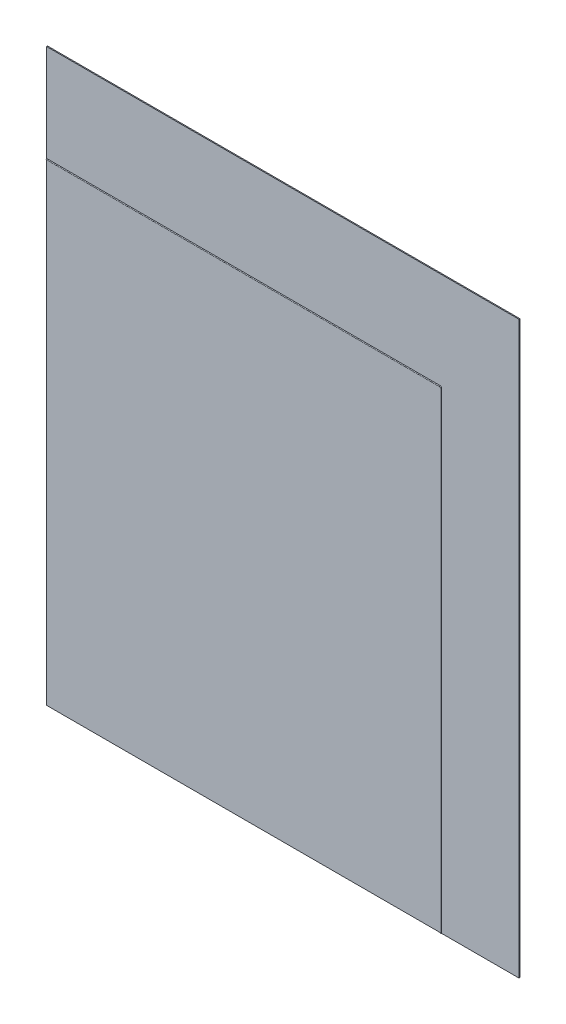
ISO-10303-21;
HEADER;
FILE_DESCRIPTION(('STEP AP214'),'2;1');
FILE_NAME('part.step','',(''),(''),'','','');
FILE_SCHEMA(('AUTOMOTIVE_DESIGN { 1 0 10303 214 1 1 1 1 }'));
ENDSEC;
DATA;
#1=APPLICATION_CONTEXT('core data for automotive mechanical design processes');
#2=APPLICATION_PROTOCOL_DEFINITION('international standard','automotive_design',2000,#1);
#3=PRODUCT_CONTEXT('',#1,'mechanical');
#4=PRODUCT('Part','Part','',(#3));
#5=PRODUCT_RELATED_PRODUCT_CATEGORY('part','',(#4));
#6=PRODUCT_DEFINITION_FORMATION('','',#4);
#7=PRODUCT_DEFINITION_CONTEXT('part definition',#1,'design');
#8=PRODUCT_DEFINITION('design','',#6,#7);
#9=PRODUCT_DEFINITION_SHAPE('','',#8);
#10=(LENGTH_UNIT() NAMED_UNIT(*) SI_UNIT(.MILLI.,.METRE.));
#11=(NAMED_UNIT(*) PLANE_ANGLE_UNIT() SI_UNIT($,.RADIAN.));
#12=(NAMED_UNIT(*) SI_UNIT($,.STERADIAN.) SOLID_ANGLE_UNIT());
#13=UNCERTAINTY_MEASURE_WITH_UNIT(LENGTH_MEASURE(1.E-05),#10,'distance_accuracy_value','');
#14=(GEOMETRIC_REPRESENTATION_CONTEXT(3) GLOBAL_UNCERTAINTY_ASSIGNED_CONTEXT((#13)) GLOBAL_UNIT_ASSIGNED_CONTEXT((#10,
#11,#12)) REPRESENTATION_CONTEXT('',''));
#15=CARTESIAN_POINT('',(0.,0.,0.));
#16=DIRECTION('',(0.,0.,1.));
#17=DIRECTION('',(1.,0.,0.));
#18=AXIS2_PLACEMENT_3D('',#15,#16,#17);
#19=CARTESIAN_POINT('',(0.,0.,2.54));
#20=DIRECTION('',(0.,0.,1.));
#21=DIRECTION('',(1.,0.,0.));
#22=AXIS2_PLACEMENT_3D('',#19,#20,#21);
#23=PLANE('',#22);
#24=CARTESIAN_POINT('',(406.4,482.6,2.54));
#25=DIRECTION('',(0.,0.,1.));
#26=DIRECTION('',(1.,0.,0.));
#27=AXIS2_PLACEMENT_3D('',#24,#25,#26);
#28=CIRCLE('',#27,3.80999999999999);
#29=CARTESIAN_POINT('',(406.4,486.41,2.54));
#30=VERTEX_POINT('',#29);
#31=CARTESIAN_POINT('',(410.21,482.599999999999,2.54));
#32=VERTEX_POINT('',#31);
#33=EDGE_CURVE('E59',#30,#32,#28,.F.);
#34=ORIENTED_EDGE('',*,*,#33,.T.);
#35=DIRECTION('',(0.,1.,0.));
#36=VECTOR('',#35,1.);
#37=CARTESIAN_POINT('',(410.21,-736.6,2.54));
#38=LINE('',#37,#36);
#39=CARTESIAN_POINT('',(410.21,-736.6,2.54));
#40=VERTEX_POINT('',#39);
#41=EDGE_CURVE('E12',#32,#40,#38,.F.);
#42=ORIENTED_EDGE('',*,*,#41,.T.);
#43=DIRECTION('',(1.,0.,0.));
#44=VECTOR('',#43,1.);
#45=CARTESIAN_POINT('',(-609.6,-736.6,2.54));
#46=LINE('',#45,#44);
#47=CARTESIAN_POINT('',(609.6,-736.6,2.54));
#48=VERTEX_POINT('',#47);
#49=EDGE_CURVE('E74',#40,#48,#46,.T.);
#50=ORIENTED_EDGE('',*,*,#49,.T.);
#51=DIRECTION('',(0.,1.,0.));
#52=VECTOR('',#51,1.);
#53=CARTESIAN_POINT('',(609.6,736.6,2.54));
#54=LINE('',#53,#52);
#55=CARTESIAN_POINT('',(609.6,736.6,2.54));
#56=VERTEX_POINT('',#55);
#57=EDGE_CURVE('E158',#48,#56,#54,.T.);
#58=ORIENTED_EDGE('',*,*,#57,.T.);
#59=DIRECTION('',(-1.,0.,0.));
#60=VECTOR('',#59,1.);
#61=CARTESIAN_POINT('',(-609.6,736.6,2.54));
#62=LINE('',#61,#60);
#63=CARTESIAN_POINT('',(-609.6,736.6,2.54));
#64=VERTEX_POINT('',#63);
#65=EDGE_CURVE('E104',#56,#64,#62,.T.);
#66=ORIENTED_EDGE('',*,*,#65,.T.);
#67=DIRECTION('',(0.,-1.,0.));
#68=VECTOR('',#67,1.);
#69=CARTESIAN_POINT('',(-609.6,736.6,2.54));
#70=LINE('',#69,#68);
#71=CARTESIAN_POINT('',(-609.6,486.41,2.54));
#72=VERTEX_POINT('',#71);
#73=EDGE_CURVE('E138',#64,#72,#70,.T.);
#74=ORIENTED_EDGE('',*,*,#73,.T.);
#75=DIRECTION('',(-1.,0.,0.));
#76=VECTOR('',#75,1.);
#77=CARTESIAN_POINT('',(406.4,486.41,2.54));
#78=LINE('',#77,#76);
#79=EDGE_CURVE('E125',#72,#30,#78,.F.);
#80=ORIENTED_EDGE('',*,*,#79,.T.);
#81=EDGE_LOOP('',(#34,#42,#50,#58,#66,#74,#80));
#82=FACE_BOUND('',#81,.T.);
#83=ADVANCED_FACE('F51',(#82),#23,.T.);
#84=CARTESIAN_POINT('',(-609.6,-736.6,2.54));
#85=VERTEX_POINT('',#84);
#86=CARTESIAN_POINT('',(407.67,-736.6,2.54));
#87=VERTEX_POINT('',#86);
#88=EDGE_CURVE('E144',#85,#87,#46,.T.);
#89=ORIENTED_EDGE('',*,*,#88,.T.);
#90=DIRECTION('',(0.,1.,0.));
#91=VECTOR('',#90,1.);
#92=CARTESIAN_POINT('',(407.67,-736.6,2.54));
#93=LINE('',#92,#91);
#94=CARTESIAN_POINT('',(407.67,482.599999999999,2.54));
#95=VERTEX_POINT('',#94);
#96=EDGE_CURVE('E131',#87,#95,#93,.T.);
#97=ORIENTED_EDGE('',*,*,#96,.T.);
#98=CARTESIAN_POINT('',(406.4,482.6,2.54));
#99=DIRECTION('',(0.,0.,-1.));
#100=DIRECTION('',(-1.,0.,0.));
#101=AXIS2_PLACEMENT_3D('',#98,#99,#100);
#102=CIRCLE('',#101,1.26999999999999);
#103=CARTESIAN_POINT('',(406.4,483.87,2.54));
#104=VERTEX_POINT('',#103);
#105=EDGE_CURVE('E168',#95,#104,#102,.F.);
#106=ORIENTED_EDGE('',*,*,#105,.T.);
#107=DIRECTION('',(-1.,0.,0.));
#108=VECTOR('',#107,1.);
#109=CARTESIAN_POINT('',(406.4,483.87,2.54));
#110=LINE('',#109,#108);
#111=CARTESIAN_POINT('',(-609.6,483.87,2.54));
#112=VERTEX_POINT('',#111);
#113=EDGE_CURVE('E166',#104,#112,#110,.T.);
#114=ORIENTED_EDGE('',*,*,#113,.T.);
#115=EDGE_CURVE('E140',#112,#85,#70,.T.);
#116=ORIENTED_EDGE('',*,*,#115,.T.);
#117=EDGE_LOOP('',(#89,#97,#106,#114,#116));
#118=FACE_BOUND('',#117,.T.);
#119=ADVANCED_FACE('F205',(#118),#23,.T.);
#120=CARTESIAN_POINT('',(609.6,736.6,2.54));
#121=DIRECTION('',(-1.,0.,0.));
#122=DIRECTION('',(0.,-1.,0.));
#123=AXIS2_PLACEMENT_3D('',#120,#121,#122);
#124=PLANE('',#123);
#125=DIRECTION('',(0.,1.,0.));
#126=VECTOR('',#125,1.);
#127=CARTESIAN_POINT('',(609.6,736.6,0.));
#128=LINE('',#127,#126);
#129=CARTESIAN_POINT('',(609.6,-736.6,0.));
#130=VERTEX_POINT('',#129);
#131=CARTESIAN_POINT('',(609.6,736.6,0.));
#132=VERTEX_POINT('',#131);
#133=EDGE_CURVE('E141',#130,#132,#128,.T.);
#134=ORIENTED_EDGE('',*,*,#133,.T.);
#135=DIRECTION('',(0.,0.,-1.));
#136=VECTOR('',#135,1.);
#137=CARTESIAN_POINT('',(609.6,736.6,2.54));
#138=LINE('',#137,#136);
#139=EDGE_CURVE('E164',#56,#132,#138,.T.);
#140=ORIENTED_EDGE('',*,*,#139,.F.);
#141=ORIENTED_EDGE('',*,*,#57,.F.);
#142=DIRECTION('',(0.,0.,-1.));
#143=VECTOR('',#142,1.);
#144=CARTESIAN_POINT('',(609.6,-736.6,2.54));
#145=LINE('',#144,#143);
#146=EDGE_CURVE('E150',#48,#130,#145,.T.);
#147=ORIENTED_EDGE('',*,*,#146,.T.);
#148=EDGE_LOOP('',(#134,#140,#141,#147));
#149=FACE_BOUND('',#148,.T.);
#150=ADVANCED_FACE('F53',(#149),#124,.F.);
#151=CARTESIAN_POINT('',(-609.6,736.6,2.54));
#152=DIRECTION('',(0.,-1.,0.));
#153=DIRECTION('',(0.,0.,-1.));
#154=AXIS2_PLACEMENT_3D('',#151,#152,#153);
#155=PLANE('',#154);
#156=DIRECTION('',(-1.,0.,0.));
#157=VECTOR('',#156,1.);
#158=CARTESIAN_POINT('',(-609.6,736.6,0.));
#159=LINE('',#158,#157);
#160=CARTESIAN_POINT('',(-609.6,736.6,0.));
#161=VERTEX_POINT('',#160);
#162=EDGE_CURVE('E153',#132,#161,#159,.T.);
#163=ORIENTED_EDGE('',*,*,#162,.T.);
#164=DIRECTION('',(0.,0.,-1.));
#165=VECTOR('',#164,1.);
#166=CARTESIAN_POINT('',(-609.6,736.6,2.54));
#167=LINE('',#166,#165);
#168=EDGE_CURVE('E162',#64,#161,#167,.T.);
#169=ORIENTED_EDGE('',*,*,#168,.F.);
#170=ORIENTED_EDGE('',*,*,#65,.F.);
#171=ORIENTED_EDGE('',*,*,#139,.T.);
#172=EDGE_LOOP('',(#163,#169,#170,#171));
#173=FACE_BOUND('',#172,.T.);
#174=ADVANCED_FACE('F187',(#173),#155,.F.);
#175=CARTESIAN_POINT('',(-609.6,736.6,2.54));
#176=DIRECTION('',(1.,0.,0.));
#177=DIRECTION('',(0.,1.,0.));
#178=AXIS2_PLACEMENT_3D('',#175,#176,#177);
#179=PLANE('',#178);
#180=ORIENTED_EDGE('',*,*,#115,.F.);
#181=CARTESIAN_POINT('',(-609.6,485.14,2.54));
#182=DIRECTION('',(1.,0.,0.));
#183=DIRECTION('',(0.,1.,0.));
#184=AXIS2_PLACEMENT_3D('',#181,#182,#183);
#185=CIRCLE('',#184,1.27);
#186=EDGE_CURVE('E66',#72,#112,#185,.T.);
#187=ORIENTED_EDGE('',*,*,#186,.F.);
#188=ORIENTED_EDGE('',*,*,#73,.F.);
#189=ORIENTED_EDGE('',*,*,#168,.T.);
#190=DIRECTION('',(0.,-1.,0.));
#191=VECTOR('',#190,1.);
#192=CARTESIAN_POINT('',(-609.6,736.6,0.));
#193=LINE('',#192,#191);
#194=CARTESIAN_POINT('',(-609.6,-736.6,0.));
#195=VERTEX_POINT('',#194);
#196=EDGE_CURVE('E155',#161,#195,#193,.T.);
#197=ORIENTED_EDGE('',*,*,#196,.T.);
#198=DIRECTION('',(0.,0.,-1.));
#199=VECTOR('',#198,1.);
#200=CARTESIAN_POINT('',(-609.6,-736.6,2.54));
#201=LINE('',#200,#199);
#202=EDGE_CURVE('E160',#85,#195,#201,.T.);
#203=ORIENTED_EDGE('',*,*,#202,.F.);
#204=EDGE_LOOP('',(#180,#187,#188,#189,#197,#203));
#205=FACE_BOUND('',#204,.T.);
#206=ADVANCED_FACE('F136',(#205),#179,.F.);
#207=CARTESIAN_POINT('',(-609.6,-736.6,2.54));
#208=DIRECTION('',(0.,1.,0.));
#209=DIRECTION('',(0.,0.,1.));
#210=AXIS2_PLACEMENT_3D('',#207,#208,#209);
#211=PLANE('',#210);
#212=ORIENTED_EDGE('',*,*,#49,.F.);
#213=CARTESIAN_POINT('',(408.94,-736.6,2.54));
#214=DIRECTION('',(0.,-1.,0.));
#215=DIRECTION('',(1.,0.,0.));
#216=AXIS2_PLACEMENT_3D('',#213,#214,#215);
#217=CIRCLE('',#216,1.27);
#218=EDGE_CURVE('E178',#40,#87,#217,.T.);
#219=ORIENTED_EDGE('',*,*,#218,.T.);
#220=ORIENTED_EDGE('',*,*,#88,.F.);
#221=ORIENTED_EDGE('',*,*,#202,.T.);
#222=DIRECTION('',(1.,0.,0.));
#223=VECTOR('',#222,1.);
#224=CARTESIAN_POINT('',(-609.6,-736.6,0.));
#225=LINE('',#224,#223);
#226=EDGE_CURVE('E96',#195,#130,#225,.T.);
#227=ORIENTED_EDGE('',*,*,#226,.T.);
#228=ORIENTED_EDGE('',*,*,#146,.F.);
#229=EDGE_LOOP('',(#212,#219,#220,#221,#227,#228));
#230=FACE_BOUND('',#229,.T.);
#231=ADVANCED_FACE('F193',(#230),#211,.F.);
#232=CARTESIAN_POINT('',(0.,0.,0.));
#233=DIRECTION('',(0.,0.,1.));
#234=DIRECTION('',(1.,0.,0.));
#235=AXIS2_PLACEMENT_3D('',#232,#233,#234);
#236=PLANE('',#235);
#237=ORIENTED_EDGE('',*,*,#133,.F.);
#238=ORIENTED_EDGE('',*,*,#226,.F.);
#239=ORIENTED_EDGE('',*,*,#196,.F.);
#240=ORIENTED_EDGE('',*,*,#162,.F.);
#241=EDGE_LOOP('',(#237,#238,#239,#240));
#242=FACE_BOUND('',#241,.T.);
#243=ADVANCED_FACE('F190',(#242),#236,.F.);
#244=CARTESIAN_POINT('',(408.94,-736.6,2.54));
#245=DIRECTION('',(0.,1.,0.));
#246=DIRECTION('',(0.,0.,1.));
#247=AXIS2_PLACEMENT_3D('',#244,#245,#246);
#248=CYLINDRICAL_SURFACE('',#247,1.27);
#249=ORIENTED_EDGE('',*,*,#41,.F.);
#250=CARTESIAN_POINT('',(408.94,482.599999999999,2.54));
#251=DIRECTION('',(0.,-1.,0.));
#252=DIRECTION('',(1.,0.,0.));
#253=AXIS2_PLACEMENT_3D('',#250,#251,#252);
#254=CIRCLE('',#253,1.27);
#255=EDGE_CURVE('E176',#32,#95,#254,.T.);
#256=ORIENTED_EDGE('',*,*,#255,.T.);
#257=ORIENTED_EDGE('',*,*,#96,.F.);
#258=ORIENTED_EDGE('',*,*,#218,.F.);
#259=EDGE_LOOP('',(#249,#256,#257,#258));
#260=FACE_BOUND('',#259,.T.);
#261=ADVANCED_FACE('F192',(#260),#248,.T.);
#262=CARTESIAN_POINT('',(406.4,482.6,2.54));
#263=DIRECTION('',(0.,0.,1.));
#264=DIRECTION('',(1.,0.,0.));
#265=AXIS2_PLACEMENT_3D('',#262,#263,#264);
#266=TOROIDAL_SURFACE('',#265,2.53999999999999,1.27);
#267=ORIENTED_EDGE('',*,*,#33,.F.);
#268=CARTESIAN_POINT('',(406.4,485.14,2.54));
#269=DIRECTION('',(1.,0.,0.));
#270=DIRECTION('',(0.,1.,0.));
#271=AXIS2_PLACEMENT_3D('',#268,#269,#270);
#272=CIRCLE('',#271,1.27);
#273=EDGE_CURVE('E128',#30,#104,#272,.T.);
#274=ORIENTED_EDGE('',*,*,#273,.T.);
#275=ORIENTED_EDGE('',*,*,#105,.F.);
#276=ORIENTED_EDGE('',*,*,#255,.F.);
#277=EDGE_LOOP('',(#267,#274,#275,#276));
#278=FACE_BOUND('',#277,.T.);
#279=ADVANCED_FACE('F174',(#278),#266,.T.);
#280=CARTESIAN_POINT('',(406.4,485.14,2.54));
#281=DIRECTION('',(-1.,0.,0.));
#282=DIRECTION('',(0.,-1.,0.));
#283=AXIS2_PLACEMENT_3D('',#280,#281,#282);
#284=CYLINDRICAL_SURFACE('',#283,1.27);
#285=ORIENTED_EDGE('',*,*,#79,.F.);
#286=ORIENTED_EDGE('',*,*,#186,.T.);
#287=ORIENTED_EDGE('',*,*,#113,.F.);
#288=ORIENTED_EDGE('',*,*,#273,.F.);
#289=EDGE_LOOP('',(#285,#286,#287,#288));
#290=FACE_BOUND('',#289,.T.);
#291=ADVANCED_FACE('F126',(#290),#284,.T.);
#292=CLOSED_SHELL('',(#83,#119,#150,#174,#206,#231,#243,#261,#279,#291));
#293=MANIFOLD_SOLID_BREP('B2',#292);
#294=ADVANCED_BREP_SHAPE_REPRESENTATION('',(#18,#293),#14);
#295=SHAPE_DEFINITION_REPRESENTATION(#9,#294);
ENDSEC;
END-ISO-10303-21;
